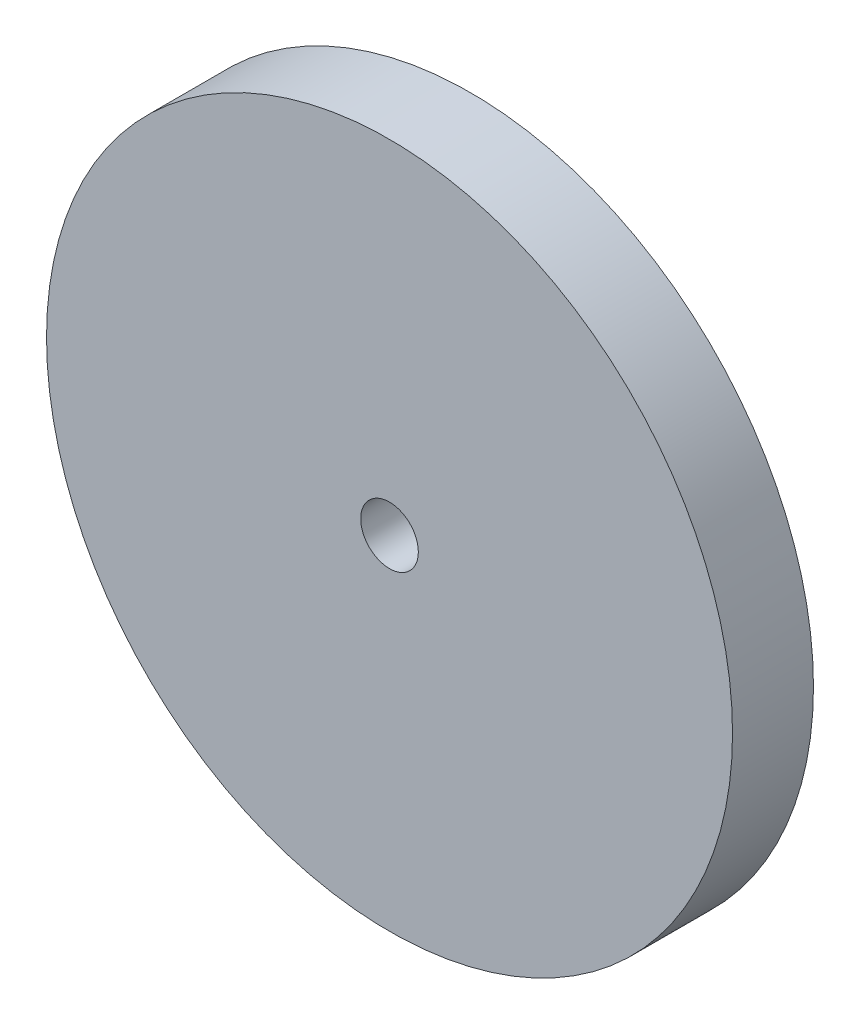
ISO-10303-21;
HEADER;
FILE_DESCRIPTION(('STEP AP214'),'2;1');
FILE_NAME('part.step','',(''),(''),'','','');
FILE_SCHEMA(('AUTOMOTIVE_DESIGN { 1 0 10303 214 1 1 1 1 }'));
ENDSEC;
DATA;
#1=APPLICATION_CONTEXT('core data for automotive mechanical design processes');
#2=APPLICATION_PROTOCOL_DEFINITION('international standard','automotive_design',2000,#1);
#3=PRODUCT_CONTEXT('',#1,'mechanical');
#4=PRODUCT('Part','Part','',(#3));
#5=PRODUCT_RELATED_PRODUCT_CATEGORY('part','',(#4));
#6=PRODUCT_DEFINITION_FORMATION('','',#4);
#7=PRODUCT_DEFINITION_CONTEXT('part definition',#1,'design');
#8=PRODUCT_DEFINITION('design','',#6,#7);
#9=PRODUCT_DEFINITION_SHAPE('','',#8);
#10=(LENGTH_UNIT() NAMED_UNIT(*) SI_UNIT(.MILLI.,.METRE.));
#11=(NAMED_UNIT(*) PLANE_ANGLE_UNIT() SI_UNIT($,.RADIAN.));
#12=(NAMED_UNIT(*) SI_UNIT($,.STERADIAN.) SOLID_ANGLE_UNIT());
#13=UNCERTAINTY_MEASURE_WITH_UNIT(LENGTH_MEASURE(1.E-05),#10,'distance_accuracy_value','');
#14=(GEOMETRIC_REPRESENTATION_CONTEXT(3) GLOBAL_UNCERTAINTY_ASSIGNED_CONTEXT((#13)) GLOBAL_UNIT_ASSIGNED_CONTEXT((#10,
#11,#12)) REPRESENTATION_CONTEXT('',''));
#15=CARTESIAN_POINT('',(0.,0.,0.));
#16=DIRECTION('',(0.,0.,1.));
#17=DIRECTION('',(1.,0.,0.));
#18=AXIS2_PLACEMENT_3D('',#15,#16,#17);
#19=CARTESIAN_POINT('',(0.,0.,5.9));
#20=DIRECTION('',(0.,0.,-1.));
#21=DIRECTION('',(-1.,0.,0.));
#22=AXIS2_PLACEMENT_3D('',#19,#20,#21);
#23=CYLINDRICAL_SURFACE('',#22,25.);
#24=CARTESIAN_POINT('',(0.,0.,5.9));
#25=DIRECTION('',(0.,0.,1.));
#26=DIRECTION('',(1.,0.,0.));
#27=AXIS2_PLACEMENT_3D('',#24,#25,#26);
#28=CIRCLE('',#27,25.);
#29=CARTESIAN_POINT('',(25.,0.,5.9));
#30=VERTEX_POINT('',#29);
#31=EDGE_CURVE('E10',#30,#30,#28,.T.);
#32=ORIENTED_EDGE('',*,*,#31,.F.);
#33=EDGE_LOOP('',(#32));
#34=FACE_BOUND('',#33,.T.);
#35=CARTESIAN_POINT('',(0.,0.,0.));
#36=DIRECTION('',(0.,0.,1.));
#37=DIRECTION('',(1.,0.,0.));
#38=AXIS2_PLACEMENT_3D('',#35,#36,#37);
#39=CIRCLE('',#38,25.);
#40=CARTESIAN_POINT('',(25.,0.,0.));
#41=VERTEX_POINT('',#40);
#42=EDGE_CURVE('E39',#41,#41,#39,.T.);
#43=ORIENTED_EDGE('',*,*,#42,.T.);
#44=EDGE_LOOP('',(#43));
#45=FACE_BOUND('',#44,.T.);
#46=ADVANCED_FACE('F36',(#34,#45),#23,.T.);
#47=CARTESIAN_POINT('',(0.,0.,5.9));
#48=DIRECTION('',(0.,0.,1.));
#49=DIRECTION('',(1.,0.,0.));
#50=AXIS2_PLACEMENT_3D('',#47,#48,#49);
#51=PLANE('',#50);
#52=CARTESIAN_POINT('',(0.,0.,5.9));
#53=DIRECTION('',(0.,0.,1.));
#54=DIRECTION('',(1.,0.,0.));
#55=AXIS2_PLACEMENT_3D('',#52,#53,#54);
#56=CIRCLE('',#55,2.1);
#57=CARTESIAN_POINT('',(2.1,0.,5.9));
#58=VERTEX_POINT('',#57);
#59=EDGE_CURVE('E50',#58,#58,#56,.T.);
#60=ORIENTED_EDGE('',*,*,#59,.F.);
#61=EDGE_LOOP('',(#60));
#62=FACE_BOUND('',#61,.T.);
#63=ORIENTED_EDGE('',*,*,#31,.T.);
#64=EDGE_LOOP('',(#63));
#65=FACE_BOUND('',#64,.T.);
#66=ADVANCED_FACE('F57',(#62,#65),#51,.T.);
#67=CARTESIAN_POINT('',(0.,0.,0.));
#68=DIRECTION('',(0.,0.,1.));
#69=DIRECTION('',(1.,0.,0.));
#70=AXIS2_PLACEMENT_3D('',#67,#68,#69);
#71=PLANE('',#70);
#72=CARTESIAN_POINT('',(0.,0.,0.));
#73=DIRECTION('',(0.,0.,1.));
#74=DIRECTION('',(1.,0.,0.));
#75=AXIS2_PLACEMENT_3D('',#72,#73,#74);
#76=CIRCLE('',#75,2.1);
#77=CARTESIAN_POINT('',(2.1,0.,0.));
#78=VERTEX_POINT('',#77);
#79=EDGE_CURVE('E46',#78,#78,#76,.F.);
#80=ORIENTED_EDGE('',*,*,#79,.F.);
#81=EDGE_LOOP('',(#80));
#82=FACE_BOUND('',#81,.T.);
#83=ORIENTED_EDGE('',*,*,#42,.F.);
#84=EDGE_LOOP('',(#83));
#85=FACE_BOUND('',#84,.T.);
#86=ADVANCED_FACE('F59',(#82,#85),#71,.F.);
#87=CARTESIAN_POINT('',(0.,0.,-0.00100000000000013));
#88=DIRECTION('',(0.,0.,1.));
#89=DIRECTION('',(1.,0.,0.));
#90=AXIS2_PLACEMENT_3D('',#87,#88,#89);
#91=CYLINDRICAL_SURFACE('',#90,2.1);
#92=ORIENTED_EDGE('',*,*,#59,.T.);
#93=EDGE_LOOP('',(#92));
#94=FACE_BOUND('',#93,.T.);
#95=ORIENTED_EDGE('',*,*,#79,.T.);
#96=EDGE_LOOP('',(#95));
#97=FACE_BOUND('',#96,.T.);
#98=ADVANCED_FACE('F54',(#94,#97),#91,.F.);
#99=CLOSED_SHELL('',(#46,#66,#86,#98));
#100=MANIFOLD_SOLID_BREP('B2',#99);
#101=ADVANCED_BREP_SHAPE_REPRESENTATION('',(#18,#100),#14);
#102=SHAPE_DEFINITION_REPRESENTATION(#9,#101);
ENDSEC;
END-ISO-10303-21;
